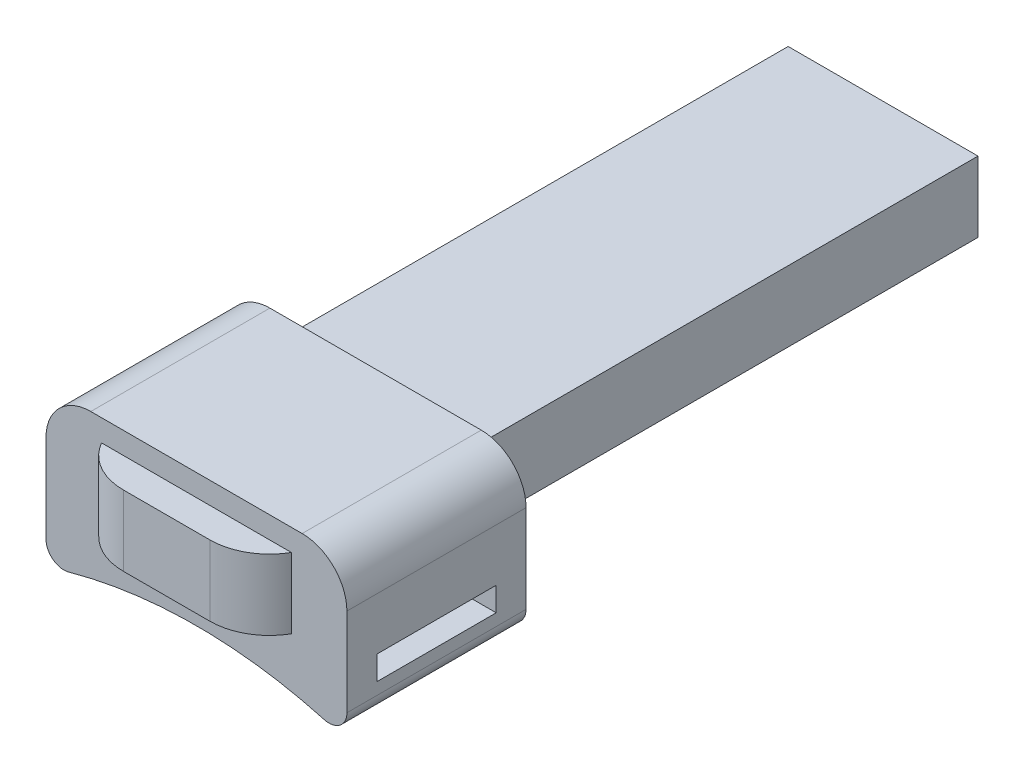
ISO-10303-21;
HEADER;
FILE_DESCRIPTION(('STEP AP214'),'2;1');
FILE_NAME('part.step','',(''),(''),'','','');
FILE_SCHEMA(('AUTOMOTIVE_DESIGN { 1 0 10303 214 1 1 1 1 }'));
ENDSEC;
DATA;
#1=APPLICATION_CONTEXT('core data for automotive mechanical design processes');
#2=APPLICATION_PROTOCOL_DEFINITION('international standard','automotive_design',2000,#1);
#3=PRODUCT_CONTEXT('',#1,'mechanical');
#4=PRODUCT('Part','Part','',(#3));
#5=PRODUCT_RELATED_PRODUCT_CATEGORY('part','',(#4));
#6=PRODUCT_DEFINITION_FORMATION('','',#4);
#7=PRODUCT_DEFINITION_CONTEXT('part definition',#1,'design');
#8=PRODUCT_DEFINITION('design','',#6,#7);
#9=PRODUCT_DEFINITION_SHAPE('','',#8);
#10=(LENGTH_UNIT() NAMED_UNIT(*) SI_UNIT(.MILLI.,.METRE.));
#11=(NAMED_UNIT(*) PLANE_ANGLE_UNIT() SI_UNIT($,.RADIAN.));
#12=(NAMED_UNIT(*) SI_UNIT($,.STERADIAN.) SOLID_ANGLE_UNIT());
#13=UNCERTAINTY_MEASURE_WITH_UNIT(LENGTH_MEASURE(1.E-05),#10,'distance_accuracy_value','');
#14=(GEOMETRIC_REPRESENTATION_CONTEXT(3) GLOBAL_UNCERTAINTY_ASSIGNED_CONTEXT((#13)) GLOBAL_UNIT_ASSIGNED_CONTEXT((#10,
#11,#12)) REPRESENTATION_CONTEXT('',''));
#15=CARTESIAN_POINT('',(0.,0.,0.));
#16=DIRECTION('',(0.,0.,1.));
#17=DIRECTION('',(1.,0.,0.));
#18=AXIS2_PLACEMENT_3D('',#15,#16,#17);
#19=CARTESIAN_POINT('',(-15.9,0.,-120.));
#20=DIRECTION('',(-1.,0.,0.));
#21=DIRECTION('',(0.,0.,1.));
#22=AXIS2_PLACEMENT_3D('',#19,#20,#21);
#23=PLANE('',#22);
#24=DIRECTION('',(0.,0.,1.));
#25=VECTOR('',#24,1.);
#26=CARTESIAN_POINT('',(-15.9,0.,-120.));
#27=LINE('',#26,#25);
#28=CARTESIAN_POINT('',(-15.9,0.,-120.));
#29=VERTEX_POINT('',#28);
#30=CARTESIAN_POINT('',(-15.9,0.,-35.));
#31=VERTEX_POINT('',#30);
#32=EDGE_CURVE('E309',#29,#31,#27,.T.);
#33=ORIENTED_EDGE('',*,*,#32,.T.);
#34=DIRECTION('',(0.,1.,0.));
#35=VECTOR('',#34,1.);
#36=CARTESIAN_POINT('',(-15.9,0.,-35.));
#37=LINE('',#36,#35);
#38=CARTESIAN_POINT('',(-15.9,11.8,-35.));
#39=VERTEX_POINT('',#38);
#40=EDGE_CURVE('E289',#31,#39,#37,.T.);
#41=ORIENTED_EDGE('',*,*,#40,.T.);
#42=DIRECTION('',(0.,0.,1.));
#43=VECTOR('',#42,1.);
#44=CARTESIAN_POINT('',(-15.9,11.8,-120.));
#45=LINE('',#44,#43);
#46=CARTESIAN_POINT('',(-15.9,11.8,-120.));
#47=VERTEX_POINT('',#46);
#48=EDGE_CURVE('E313',#47,#39,#45,.T.);
#49=ORIENTED_EDGE('',*,*,#48,.F.);
#50=DIRECTION('',(0.,-1.,0.));
#51=VECTOR('',#50,1.);
#52=CARTESIAN_POINT('',(-15.9,0.,-120.));
#53=LINE('',#52,#51);
#54=EDGE_CURVE('E302',#47,#29,#53,.T.);
#55=ORIENTED_EDGE('',*,*,#54,.T.);
#56=EDGE_LOOP('',(#33,#41,#49,#55));
#57=FACE_BOUND('',#56,.T.);
#58=ADVANCED_FACE('F39',(#57),#23,.T.);
#59=CARTESIAN_POINT('',(-15.9,11.8,-120.));
#60=DIRECTION('',(0.,1.,0.));
#61=DIRECTION('',(0.,0.,1.));
#62=AXIS2_PLACEMENT_3D('',#59,#60,#61);
#63=PLANE('',#62);
#64=ORIENTED_EDGE('',*,*,#48,.T.);
#65=DIRECTION('',(1.,0.,0.));
#66=VECTOR('',#65,1.);
#67=CARTESIAN_POINT('',(-15.9,11.8,-35.));
#68=LINE('',#67,#66);
#69=CARTESIAN_POINT('',(15.9,11.8,-35.));
#70=VERTEX_POINT('',#69);
#71=EDGE_CURVE('E286',#39,#70,#68,.T.);
#72=ORIENTED_EDGE('',*,*,#71,.T.);
#73=DIRECTION('',(0.,0.,1.));
#74=VECTOR('',#73,1.);
#75=CARTESIAN_POINT('',(15.9,11.8,-120.));
#76=LINE('',#75,#74);
#77=CARTESIAN_POINT('',(15.9,11.8,-120.));
#78=VERTEX_POINT('',#77);
#79=EDGE_CURVE('E316',#78,#70,#76,.T.);
#80=ORIENTED_EDGE('',*,*,#79,.F.);
#81=DIRECTION('',(-1.,0.,0.));
#82=VECTOR('',#81,1.);
#83=CARTESIAN_POINT('',(-15.9,11.8,-120.));
#84=LINE('',#83,#82);
#85=EDGE_CURVE('E299',#78,#47,#84,.T.);
#86=ORIENTED_EDGE('',*,*,#85,.T.);
#87=EDGE_LOOP('',(#64,#72,#80,#86));
#88=FACE_BOUND('',#87,.T.);
#89=ADVANCED_FACE('F363',(#88),#63,.T.);
#90=CARTESIAN_POINT('',(15.9,11.8,-120.));
#91=DIRECTION('',(1.,0.,0.));
#92=DIRECTION('',(0.,0.,-1.));
#93=AXIS2_PLACEMENT_3D('',#90,#91,#92);
#94=PLANE('',#93);
#95=ORIENTED_EDGE('',*,*,#79,.T.);
#96=DIRECTION('',(0.,-1.,0.));
#97=VECTOR('',#96,1.);
#98=CARTESIAN_POINT('',(15.9,11.8,-35.));
#99=LINE('',#98,#97);
#100=CARTESIAN_POINT('',(15.9,0.,-35.));
#101=VERTEX_POINT('',#100);
#102=EDGE_CURVE('E283',#70,#101,#99,.T.);
#103=ORIENTED_EDGE('',*,*,#102,.T.);
#104=DIRECTION('',(0.,0.,1.));
#105=VECTOR('',#104,1.);
#106=CARTESIAN_POINT('',(15.9,0.,-120.));
#107=LINE('',#106,#105);
#108=CARTESIAN_POINT('',(15.9,0.,-120.));
#109=VERTEX_POINT('',#108);
#110=EDGE_CURVE('E305',#109,#101,#107,.T.);
#111=ORIENTED_EDGE('',*,*,#110,.F.);
#112=DIRECTION('',(0.,1.,0.));
#113=VECTOR('',#112,1.);
#114=CARTESIAN_POINT('',(15.9,11.8,-120.));
#115=LINE('',#114,#113);
#116=EDGE_CURVE('E295',#109,#78,#115,.T.);
#117=ORIENTED_EDGE('',*,*,#116,.T.);
#118=EDGE_LOOP('',(#95,#103,#111,#117));
#119=FACE_BOUND('',#118,.T.);
#120=ADVANCED_FACE('F371',(#119),#94,.T.);
#121=CARTESIAN_POINT('',(0.,0.,-120.));
#122=DIRECTION('',(0.,-1.,0.));
#123=DIRECTION('',(0.,0.,-1.));
#124=AXIS2_PLACEMENT_3D('',#121,#122,#123);
#125=PLANE('',#124);
#126=ORIENTED_EDGE('',*,*,#110,.T.);
#127=DIRECTION('',(-1.,0.,0.));
#128=VECTOR('',#127,1.);
#129=CARTESIAN_POINT('',(0.,0.,-35.));
#130=LINE('',#129,#128);
#131=EDGE_CURVE('E323',#101,#31,#130,.T.);
#132=ORIENTED_EDGE('',*,*,#131,.T.);
#133=ORIENTED_EDGE('',*,*,#32,.F.);
#134=DIRECTION('',(1.,0.,0.));
#135=VECTOR('',#134,1.);
#136=CARTESIAN_POINT('',(0.,0.,-120.));
#137=LINE('',#136,#135);
#138=EDGE_CURVE('E293',#29,#109,#137,.T.);
#139=ORIENTED_EDGE('',*,*,#138,.T.);
#140=EDGE_LOOP('',(#126,#132,#133,#139));
#141=FACE_BOUND('',#140,.T.);
#142=ADVANCED_FACE('F377',(#141),#125,.T.);
#143=CARTESIAN_POINT('',(0.,0.,-120.));
#144=DIRECTION('',(0.,0.,-1.));
#145=DIRECTION('',(-1.,0.,0.));
#146=AXIS2_PLACEMENT_3D('',#143,#144,#145);
#147=PLANE('',#146);
#148=ORIENTED_EDGE('',*,*,#138,.F.);
#149=ORIENTED_EDGE('',*,*,#54,.F.);
#150=ORIENTED_EDGE('',*,*,#85,.F.);
#151=ORIENTED_EDGE('',*,*,#116,.F.);
#152=EDGE_LOOP('',(#148,#149,#150,#151));
#153=FACE_BOUND('',#152,.T.);
#154=ADVANCED_FACE('F384',(#153),#147,.T.);
#155=CARTESIAN_POINT('',(0.,-86.7751107448839,-35.));
#156=DIRECTION('',(0.,0.,1.));
#157=DIRECTION('',(1.,0.,0.));
#158=AXIS2_PLACEMENT_3D('',#155,#156,#157);
#159=CYLINDRICAL_SURFACE('',#158,80.);
#160=CARTESIAN_POINT('',(0.,-86.7751107448839,-5.));
#161=DIRECTION('',(0.,0.,-1.));
#162=DIRECTION('',(1.,0.,0.));
#163=AXIS2_PLACEMENT_3D('',#160,#161,#162);
#164=CIRCLE('',#163,80.);
#165=CARTESIAN_POINT('',(-21.3975903614458,-9.68981301098555,-5.));
#166=VERTEX_POINT('',#165);
#167=CARTESIAN_POINT('',(21.3975903614458,-9.68981301098554,-5.));
#168=VERTEX_POINT('',#167);
#169=EDGE_CURVE('E210',#166,#168,#164,.T.);
#170=ORIENTED_EDGE('',*,*,#169,.F.);
#171=DIRECTION('',(0.,0.,1.));
#172=VECTOR('',#171,1.);
#173=CARTESIAN_POINT('',(-21.3975903614458,-9.68981301098555,-35.));
#174=LINE('',#173,#172);
#175=CARTESIAN_POINT('',(-21.3975903614458,-9.68981301098555,-35.));
#176=VERTEX_POINT('',#175);
#177=EDGE_CURVE('E256',#176,#166,#174,.T.);
#178=ORIENTED_EDGE('',*,*,#177,.F.);
#179=CARTESIAN_POINT('',(0.,-86.7751107448839,-35.));
#180=DIRECTION('',(0.,0.,-1.));
#181=DIRECTION('',(1.,0.,0.));
#182=AXIS2_PLACEMENT_3D('',#179,#180,#181);
#183=CIRCLE('',#182,80.);
#184=CARTESIAN_POINT('',(21.3975903614458,-9.68981301098554,-35.));
#185=VERTEX_POINT('',#184);
#186=EDGE_CURVE('E211',#176,#185,#183,.T.);
#187=ORIENTED_EDGE('',*,*,#186,.T.);
#188=DIRECTION('',(0.,0.,1.));
#189=VECTOR('',#188,1.);
#190=CARTESIAN_POINT('',(21.3975903614458,-9.68981301098554,-35.));
#191=LINE('',#190,#189);
#192=EDGE_CURVE('E233',#185,#168,#191,.T.);
#193=ORIENTED_EDGE('',*,*,#192,.T.);
#194=EDGE_LOOP('',(#170,#178,#187,#193));
#195=FACE_BOUND('',#194,.T.);
#196=ADVANCED_FACE('F389',(#195),#159,.F.);
#197=CARTESIAN_POINT('',(-22.2,-6.79911434596435,-35.));
#198=DIRECTION('',(0.,0.,1.));
#199=DIRECTION('',(1.,0.,0.));
#200=AXIS2_PLACEMENT_3D('',#197,#198,#199);
#201=CYLINDRICAL_SURFACE('',#200,3.00000000000001);
#202=CARTESIAN_POINT('',(-22.2,-6.79911434596435,-5.));
#203=DIRECTION('',(0.,0.,1.));
#204=DIRECTION('',(1.,0.,0.));
#205=AXIS2_PLACEMENT_3D('',#202,#203,#204);
#206=CIRCLE('',#205,3.00000000000001);
#207=CARTESIAN_POINT('',(-25.2,-6.79911434596435,-5.));
#208=VERTEX_POINT('',#207);
#209=EDGE_CURVE('E215',#208,#166,#206,.T.);
#210=ORIENTED_EDGE('',*,*,#209,.F.);
#211=DIRECTION('',(0.,0.,1.));
#212=VECTOR('',#211,1.);
#213=CARTESIAN_POINT('',(-25.2,-6.79911434596435,-35.));
#214=LINE('',#213,#212);
#215=CARTESIAN_POINT('',(-25.2,-6.79911434596435,-35.));
#216=VERTEX_POINT('',#215);
#217=EDGE_CURVE('E259',#216,#208,#214,.T.);
#218=ORIENTED_EDGE('',*,*,#217,.F.);
#219=CARTESIAN_POINT('',(-22.2,-6.79911434596435,-35.));
#220=DIRECTION('',(0.,0.,1.));
#221=DIRECTION('',(1.,0.,0.));
#222=AXIS2_PLACEMENT_3D('',#219,#220,#221);
#223=CIRCLE('',#222,3.00000000000001);
#224=EDGE_CURVE('E230',#216,#176,#223,.T.);
#225=ORIENTED_EDGE('',*,*,#224,.T.);
#226=ORIENTED_EDGE('',*,*,#177,.T.);
#227=EDGE_LOOP('',(#210,#218,#225,#226));
#228=FACE_BOUND('',#227,.T.);
#229=ADVANCED_FACE('F411',(#228),#201,.T.);
#230=CARTESIAN_POINT('',(-25.2,-4.05,-35.));
#231=DIRECTION('',(-1.,0.,0.));
#232=DIRECTION('',(0.,0.,1.));
#233=AXIS2_PLACEMENT_3D('',#230,#231,#232);
#234=PLANE('',#233);
#235=DIRECTION('',(0.,1.,0.));
#236=VECTOR('',#235,1.);
#237=CARTESIAN_POINT('',(-25.2,-4.05,-10.));
#238=LINE('',#237,#236);
#239=CARTESIAN_POINT('',(-25.2,-4.79911434596435,-10.));
#240=VERTEX_POINT('',#239);
#241=CARTESIAN_POINT('',(-25.2,-0.799114345964353,-10.));
#242=VERTEX_POINT('',#241);
#243=EDGE_CURVE('E208',#240,#242,#238,.T.);
#244=ORIENTED_EDGE('',*,*,#243,.F.);
#245=DIRECTION('',(0.,0.,1.));
#246=VECTOR('',#245,1.);
#247=CARTESIAN_POINT('',(-25.2,-4.79911434596435,-35.));
#248=LINE('',#247,#246);
#249=CARTESIAN_POINT('',(-25.2,-4.79911434596435,-30.));
#250=VERTEX_POINT('',#249);
#251=EDGE_CURVE('E200',#250,#240,#248,.T.);
#252=ORIENTED_EDGE('',*,*,#251,.F.);
#253=DIRECTION('',(0.,-1.,0.));
#254=VECTOR('',#253,1.);
#255=CARTESIAN_POINT('',(-25.2,-4.05,-30.));
#256=LINE('',#255,#254);
#257=CARTESIAN_POINT('',(-25.2,-0.799114345964351,-30.));
#258=VERTEX_POINT('',#257);
#259=EDGE_CURVE('E181',#258,#250,#256,.T.);
#260=ORIENTED_EDGE('',*,*,#259,.F.);
#261=DIRECTION('',(0.,0.,-1.));
#262=VECTOR('',#261,1.);
#263=CARTESIAN_POINT('',(-25.2,-0.799114345964351,-35.));
#264=LINE('',#263,#262);
#265=EDGE_CURVE('E206',#242,#258,#264,.T.);
#266=ORIENTED_EDGE('',*,*,#265,.F.);
#267=EDGE_LOOP('',(#244,#252,#260,#266));
#268=FACE_BOUND('',#267,.T.);
#269=DIRECTION('',(0.,-1.,0.));
#270=VECTOR('',#269,1.);
#271=CARTESIAN_POINT('',(-25.2,-4.05,-5.));
#272=LINE('',#271,#270);
#273=CARTESIAN_POINT('',(-25.2,7.95,-5.));
#274=VERTEX_POINT('',#273);
#275=EDGE_CURVE('E251',#274,#208,#272,.T.);
#276=ORIENTED_EDGE('',*,*,#275,.F.);
#277=DIRECTION('',(0.,0.,1.));
#278=VECTOR('',#277,1.);
#279=CARTESIAN_POINT('',(-25.2,7.95,-35.));
#280=LINE('',#279,#278);
#281=CARTESIAN_POINT('',(-25.2,7.95,-35.));
#282=VERTEX_POINT('',#281);
#283=EDGE_CURVE('E261',#282,#274,#280,.T.);
#284=ORIENTED_EDGE('',*,*,#283,.F.);
#285=DIRECTION('',(0.,-1.,0.));
#286=VECTOR('',#285,1.);
#287=CARTESIAN_POINT('',(-25.2,7.95,-35.));
#288=LINE('',#287,#286);
#289=EDGE_CURVE('E228',#282,#216,#288,.T.);
#290=ORIENTED_EDGE('',*,*,#289,.T.);
#291=ORIENTED_EDGE('',*,*,#217,.T.);
#292=EDGE_LOOP('',(#276,#284,#290,#291));
#293=FACE_BOUND('',#292,.T.);
#294=ADVANCED_FACE('F414',(#268,#293),#234,.T.);
#295=CARTESIAN_POINT('',(-17.7,7.95,-35.));
#296=DIRECTION('',(0.,0.,1.));
#297=DIRECTION('',(1.,0.,0.));
#298=AXIS2_PLACEMENT_3D('',#295,#296,#297);
#299=CYLINDRICAL_SURFACE('',#298,7.5);
#300=CARTESIAN_POINT('',(-17.7,7.95,-5.));
#301=DIRECTION('',(0.,0.,1.));
#302=DIRECTION('',(1.,0.,0.));
#303=AXIS2_PLACEMENT_3D('',#300,#301,#302);
#304=CIRCLE('',#303,7.5);
#305=CARTESIAN_POINT('',(-17.7,15.45,-5.));
#306=VERTEX_POINT('',#305);
#307=EDGE_CURVE('E248',#306,#274,#304,.T.);
#308=ORIENTED_EDGE('',*,*,#307,.F.);
#309=DIRECTION('',(0.,0.,1.));
#310=VECTOR('',#309,1.);
#311=CARTESIAN_POINT('',(-17.7,15.45,-35.));
#312=LINE('',#311,#310);
#313=CARTESIAN_POINT('',(-17.7,15.45,-35.));
#314=VERTEX_POINT('',#313);
#315=EDGE_CURVE('E264',#314,#306,#312,.T.);
#316=ORIENTED_EDGE('',*,*,#315,.F.);
#317=CARTESIAN_POINT('',(-17.7,7.95,-35.));
#318=DIRECTION('',(0.,0.,1.));
#319=DIRECTION('',(1.,0.,0.));
#320=AXIS2_PLACEMENT_3D('',#317,#318,#319);
#321=CIRCLE('',#320,7.5);
#322=EDGE_CURVE('E225',#314,#282,#321,.T.);
#323=ORIENTED_EDGE('',*,*,#322,.T.);
#324=ORIENTED_EDGE('',*,*,#283,.T.);
#325=EDGE_LOOP('',(#308,#316,#323,#324));
#326=FACE_BOUND('',#325,.T.);
#327=ADVANCED_FACE('F418',(#326),#299,.T.);
#328=CARTESIAN_POINT('',(-15.9,15.45,-35.));
#329=DIRECTION('',(0.,1.,0.));
#330=DIRECTION('',(0.,0.,1.));
#331=AXIS2_PLACEMENT_3D('',#328,#329,#330);
#332=PLANE('',#331);
#333=DIRECTION('',(-1.,0.,0.));
#334=VECTOR('',#333,1.);
#335=CARTESIAN_POINT('',(-15.9,15.45,-5.));
#336=LINE('',#335,#334);
#337=CARTESIAN_POINT('',(17.7,15.45,-5.));
#338=VERTEX_POINT('',#337);
#339=EDGE_CURVE('E245',#338,#306,#336,.T.);
#340=ORIENTED_EDGE('',*,*,#339,.F.);
#341=DIRECTION('',(0.,0.,1.));
#342=VECTOR('',#341,1.);
#343=CARTESIAN_POINT('',(17.7,15.45,-35.));
#344=LINE('',#343,#342);
#345=CARTESIAN_POINT('',(17.7,15.45,-35.));
#346=VERTEX_POINT('',#345);
#347=EDGE_CURVE('E266',#346,#338,#344,.T.);
#348=ORIENTED_EDGE('',*,*,#347,.F.);
#349=DIRECTION('',(-1.,0.,0.));
#350=VECTOR('',#349,1.);
#351=CARTESIAN_POINT('',(-15.9,15.45,-35.));
#352=LINE('',#351,#350);
#353=EDGE_CURVE('E223',#346,#314,#352,.T.);
#354=ORIENTED_EDGE('',*,*,#353,.T.);
#355=ORIENTED_EDGE('',*,*,#315,.T.);
#356=EDGE_LOOP('',(#340,#348,#354,#355));
#357=FACE_BOUND('',#356,.T.);
#358=ADVANCED_FACE('F442',(#357),#332,.T.);
#359=CARTESIAN_POINT('',(17.7,7.95,-35.));
#360=DIRECTION('',(0.,0.,1.));
#361=DIRECTION('',(1.,0.,0.));
#362=AXIS2_PLACEMENT_3D('',#359,#360,#361);
#363=CYLINDRICAL_SURFACE('',#362,7.5);
#364=CARTESIAN_POINT('',(17.7,7.95,-5.));
#365=DIRECTION('',(0.,0.,1.));
#366=DIRECTION('',(1.,0.,0.));
#367=AXIS2_PLACEMENT_3D('',#364,#365,#366);
#368=CIRCLE('',#367,7.5);
#369=CARTESIAN_POINT('',(25.2,7.95,-5.));
#370=VERTEX_POINT('',#369);
#371=EDGE_CURVE('E242',#370,#338,#368,.T.);
#372=ORIENTED_EDGE('',*,*,#371,.F.);
#373=DIRECTION('',(0.,0.,1.));
#374=VECTOR('',#373,1.);
#375=CARTESIAN_POINT('',(25.2,7.95,-35.));
#376=LINE('',#375,#374);
#377=CARTESIAN_POINT('',(25.2,7.95,-35.));
#378=VERTEX_POINT('',#377);
#379=EDGE_CURVE('E269',#378,#370,#376,.T.);
#380=ORIENTED_EDGE('',*,*,#379,.F.);
#381=CARTESIAN_POINT('',(17.7,7.95,-35.));
#382=DIRECTION('',(0.,0.,1.));
#383=DIRECTION('',(1.,0.,0.));
#384=AXIS2_PLACEMENT_3D('',#381,#382,#383);
#385=CIRCLE('',#384,7.5);
#386=EDGE_CURVE('E220',#378,#346,#385,.T.);
#387=ORIENTED_EDGE('',*,*,#386,.T.);
#388=ORIENTED_EDGE('',*,*,#347,.T.);
#389=EDGE_LOOP('',(#372,#380,#387,#388));
#390=FACE_BOUND('',#389,.T.);
#391=ADVANCED_FACE('F426',(#390),#363,.T.);
#392=CARTESIAN_POINT('',(25.2,7.95,-35.));
#393=DIRECTION('',(1.,0.,0.));
#394=DIRECTION('',(0.,0.,-1.));
#395=AXIS2_PLACEMENT_3D('',#392,#393,#394);
#396=PLANE('',#395);
#397=DIRECTION('',(0.,-1.,0.));
#398=VECTOR('',#397,1.);
#399=CARTESIAN_POINT('',(25.2,-0.799114345964353,-10.));
#400=LINE('',#399,#398);
#401=CARTESIAN_POINT('',(25.2,-0.799114345964353,-10.));
#402=VERTEX_POINT('',#401);
#403=CARTESIAN_POINT('',(25.2,-4.79911434596435,-10.));
#404=VERTEX_POINT('',#403);
#405=EDGE_CURVE('E62',#402,#404,#400,.T.);
#406=ORIENTED_EDGE('',*,*,#405,.F.);
#407=DIRECTION('',(0.,0.,1.));
#408=VECTOR('',#407,1.);
#409=CARTESIAN_POINT('',(25.2,-0.799114345964351,-30.));
#410=LINE('',#409,#408);
#411=CARTESIAN_POINT('',(25.2,-0.799114345964351,-30.));
#412=VERTEX_POINT('',#411);
#413=EDGE_CURVE('E194',#412,#402,#410,.T.);
#414=ORIENTED_EDGE('',*,*,#413,.F.);
#415=DIRECTION('',(0.,1.,0.));
#416=VECTOR('',#415,1.);
#417=CARTESIAN_POINT('',(25.2,-4.79911434596435,-30.));
#418=LINE('',#417,#416);
#419=CARTESIAN_POINT('',(25.2,-4.79911434596435,-30.));
#420=VERTEX_POINT('',#419);
#421=EDGE_CURVE('E178',#420,#412,#418,.T.);
#422=ORIENTED_EDGE('',*,*,#421,.F.);
#423=DIRECTION('',(0.,0.,-1.));
#424=VECTOR('',#423,1.);
#425=CARTESIAN_POINT('',(25.2,-4.79911434596435,-20.));
#426=LINE('',#425,#424);
#427=EDGE_CURVE('E186',#404,#420,#426,.T.);
#428=ORIENTED_EDGE('',*,*,#427,.F.);
#429=EDGE_LOOP('',(#406,#414,#422,#428));
#430=FACE_BOUND('',#429,.T.);
#431=DIRECTION('',(0.,1.,0.));
#432=VECTOR('',#431,1.);
#433=CARTESIAN_POINT('',(25.2,7.95,-5.));
#434=LINE('',#433,#432);
#435=CARTESIAN_POINT('',(25.2,-6.79911434596435,-5.));
#436=VERTEX_POINT('',#435);
#437=EDGE_CURVE('E239',#436,#370,#434,.T.);
#438=ORIENTED_EDGE('',*,*,#437,.F.);
#439=DIRECTION('',(0.,0.,1.));
#440=VECTOR('',#439,1.);
#441=CARTESIAN_POINT('',(25.2,-6.79911434596435,-35.));
#442=LINE('',#441,#440);
#443=CARTESIAN_POINT('',(25.2,-6.79911434596435,-35.));
#444=VERTEX_POINT('',#443);
#445=EDGE_CURVE('E271',#444,#436,#442,.T.);
#446=ORIENTED_EDGE('',*,*,#445,.F.);
#447=DIRECTION('',(0.,1.,0.));
#448=VECTOR('',#447,1.);
#449=CARTESIAN_POINT('',(25.2,-6.79911434596435,-35.));
#450=LINE('',#449,#448);
#451=EDGE_CURVE('E218',#444,#378,#450,.T.);
#452=ORIENTED_EDGE('',*,*,#451,.T.);
#453=ORIENTED_EDGE('',*,*,#379,.T.);
#454=EDGE_LOOP('',(#438,#446,#452,#453));
#455=FACE_BOUND('',#454,.T.);
#456=ADVANCED_FACE('F191',(#430,#455),#396,.T.);
#457=CARTESIAN_POINT('',(22.2,-6.79911434596435,-35.));
#458=DIRECTION('',(0.,0.,1.));
#459=DIRECTION('',(1.,0.,0.));
#460=AXIS2_PLACEMENT_3D('',#457,#458,#459);
#461=CYLINDRICAL_SURFACE('',#460,3.00000000000001);
#462=CARTESIAN_POINT('',(22.2,-6.79911434596435,-5.));
#463=DIRECTION('',(0.,0.,1.));
#464=DIRECTION('',(1.,0.,0.));
#465=AXIS2_PLACEMENT_3D('',#462,#463,#464);
#466=CIRCLE('',#465,3.00000000000001);
#467=EDGE_CURVE('E236',#168,#436,#466,.T.);
#468=ORIENTED_EDGE('',*,*,#467,.F.);
#469=ORIENTED_EDGE('',*,*,#192,.F.);
#470=CARTESIAN_POINT('',(22.2,-6.79911434596435,-35.));
#471=DIRECTION('',(0.,0.,1.));
#472=DIRECTION('',(1.,0.,0.));
#473=AXIS2_PLACEMENT_3D('',#470,#471,#472);
#474=CIRCLE('',#473,3.00000000000001);
#475=EDGE_CURVE('E214',#185,#444,#474,.T.);
#476=ORIENTED_EDGE('',*,*,#475,.T.);
#477=ORIENTED_EDGE('',*,*,#445,.T.);
#478=EDGE_LOOP('',(#468,#469,#476,#477));
#479=FACE_BOUND('',#478,.T.);
#480=ADVANCED_FACE('F400',(#479),#461,.T.);
#481=CARTESIAN_POINT('',(0.,-86.7751107448839,-35.));
#482=DIRECTION('',(0.,0.,1.));
#483=DIRECTION('',(1.,0.,0.));
#484=AXIS2_PLACEMENT_3D('',#481,#482,#483);
#485=PLANE('',#484);
#486=ORIENTED_EDGE('',*,*,#40,.F.);
#487=ORIENTED_EDGE('',*,*,#131,.F.);
#488=ORIENTED_EDGE('',*,*,#102,.F.);
#489=ORIENTED_EDGE('',*,*,#71,.F.);
#490=EDGE_LOOP('',(#486,#487,#488,#489));
#491=FACE_BOUND('',#490,.T.);
#492=ORIENTED_EDGE('',*,*,#186,.F.);
#493=ORIENTED_EDGE('',*,*,#224,.F.);
#494=ORIENTED_EDGE('',*,*,#289,.F.);
#495=ORIENTED_EDGE('',*,*,#322,.F.);
#496=ORIENTED_EDGE('',*,*,#353,.F.);
#497=ORIENTED_EDGE('',*,*,#386,.F.);
#498=ORIENTED_EDGE('',*,*,#451,.F.);
#499=ORIENTED_EDGE('',*,*,#475,.F.);
#500=EDGE_LOOP('',(#492,#493,#494,#495,#496,#497,#498,#499));
#501=FACE_BOUND('',#500,.T.);
#502=ADVANCED_FACE('F397',(#491,#501),#485,.F.);
#503=CARTESIAN_POINT('',(0.,-86.7751107448839,-5.));
#504=DIRECTION('',(0.,0.,1.));
#505=DIRECTION('',(1.,0.,0.));
#506=AXIS2_PLACEMENT_3D('',#503,#504,#505);
#507=PLANE('',#506);
#508=DIRECTION('',(-1.,0.,0.));
#509=VECTOR('',#508,1.);
#510=CARTESIAN_POINT('',(0.,0.,-5.));
#511=LINE('',#510,#509);
#512=CARTESIAN_POINT('',(15.9,0.,-5.));
#513=VERTEX_POINT('',#512);
#514=CARTESIAN_POINT('',(-15.9,0.,-5.));
#515=VERTEX_POINT('',#514);
#516=EDGE_CURVE('E312',#513,#515,#511,.T.);
#517=ORIENTED_EDGE('',*,*,#516,.T.);
#518=DIRECTION('',(0.,1.,0.));
#519=VECTOR('',#518,1.);
#520=CARTESIAN_POINT('',(-15.9,0.,-5.));
#521=LINE('',#520,#519);
#522=CARTESIAN_POINT('',(-15.9,11.8,-5.));
#523=VERTEX_POINT('',#522);
#524=EDGE_CURVE('E280',#515,#523,#521,.T.);
#525=ORIENTED_EDGE('',*,*,#524,.T.);
#526=DIRECTION('',(1.,0.,0.));
#527=VECTOR('',#526,1.);
#528=CARTESIAN_POINT('',(-15.9,11.8,-5.));
#529=LINE('',#528,#527);
#530=CARTESIAN_POINT('',(15.9,11.8,-5.));
#531=VERTEX_POINT('',#530);
#532=EDGE_CURVE('E277',#523,#531,#529,.T.);
#533=ORIENTED_EDGE('',*,*,#532,.T.);
#534=DIRECTION('',(0.,-1.,0.));
#535=VECTOR('',#534,1.);
#536=CARTESIAN_POINT('',(15.9,11.8,-5.));
#537=LINE('',#536,#535);
#538=EDGE_CURVE('E258',#531,#513,#537,.T.);
#539=ORIENTED_EDGE('',*,*,#538,.T.);
#540=EDGE_LOOP('',(#517,#525,#533,#539));
#541=FACE_BOUND('',#540,.T.);
#542=ORIENTED_EDGE('',*,*,#169,.T.);
#543=ORIENTED_EDGE('',*,*,#467,.T.);
#544=ORIENTED_EDGE('',*,*,#437,.T.);
#545=ORIENTED_EDGE('',*,*,#371,.T.);
#546=ORIENTED_EDGE('',*,*,#339,.T.);
#547=ORIENTED_EDGE('',*,*,#307,.T.);
#548=ORIENTED_EDGE('',*,*,#275,.T.);
#549=ORIENTED_EDGE('',*,*,#209,.T.);
#550=EDGE_LOOP('',(#542,#543,#544,#545,#546,#547,#548,#549));
#551=FACE_BOUND('',#550,.T.);
#552=ADVANCED_FACE('F343',(#541,#551),#507,.T.);
#553=CARTESIAN_POINT('',(0.,0.,0.));
#554=DIRECTION('',(0.,0.,-1.));
#555=DIRECTION('',(-1.,0.,0.));
#556=AXIS2_PLACEMENT_3D('',#553,#554,#555);
#557=PLANE('',#556);
#558=DIRECTION('',(-1.,0.,0.));
#559=VECTOR('',#558,1.);
#560=CARTESIAN_POINT('',(-15.9,11.8,0.));
#561=LINE('',#560,#559);
#562=CARTESIAN_POINT('',(7.23974596215561,11.8,0.));
#563=VERTEX_POINT('',#562);
#564=CARTESIAN_POINT('',(-7.23974596215561,11.8,0.));
#565=VERTEX_POINT('',#564);
#566=EDGE_CURVE('E296',#563,#565,#561,.T.);
#567=ORIENTED_EDGE('',*,*,#566,.T.);
#568=DIRECTION('',(0.,1.,0.));
#569=VECTOR('',#568,1.);
#570=CARTESIAN_POINT('',(-7.23974596215561,0.,0.));
#571=LINE('',#570,#569);
#572=CARTESIAN_POINT('',(-7.23974596215561,0.,0.));
#573=VERTEX_POINT('',#572);
#574=EDGE_CURVE('E334',#565,#573,#571,.F.);
#575=ORIENTED_EDGE('',*,*,#574,.T.);
#576=DIRECTION('',(1.,0.,0.));
#577=VECTOR('',#576,1.);
#578=CARTESIAN_POINT('',(0.,0.,0.));
#579=LINE('',#578,#577);
#580=CARTESIAN_POINT('',(7.23974596215561,0.,0.));
#581=VERTEX_POINT('',#580);
#582=EDGE_CURVE('E292',#573,#581,#579,.T.);
#583=ORIENTED_EDGE('',*,*,#582,.T.);
#584=DIRECTION('',(0.,-1.,0.));
#585=VECTOR('',#584,1.);
#586=CARTESIAN_POINT('',(7.23974596215561,0.,0.));
#587=LINE('',#586,#585);
#588=EDGE_CURVE('E326',#581,#563,#587,.F.);
#589=ORIENTED_EDGE('',*,*,#588,.T.);
#590=EDGE_LOOP('',(#567,#575,#583,#589));
#591=FACE_BOUND('',#590,.T.);
#592=ADVANCED_FACE('F352',(#591),#557,.F.);
#593=ORIENTED_EDGE('',*,*,#582,.F.);
#594=CARTESIAN_POINT('',(-7.23974596215561,0.,-10.));
#595=DIRECTION('',(0.,-1.,0.));
#596=DIRECTION('',(0.,0.,-1.));
#597=AXIS2_PLACEMENT_3D('',#594,#595,#596);
#598=CIRCLE('',#597,10.);
#599=EDGE_CURVE('E47',#573,#515,#598,.T.);
#600=ORIENTED_EDGE('',*,*,#599,.T.);
#601=ORIENTED_EDGE('',*,*,#516,.F.);
#602=CARTESIAN_POINT('',(7.23974596215561,0.,-10.));
#603=DIRECTION('',(0.,-1.,0.));
#604=DIRECTION('',(0.,0.,-1.));
#605=AXIS2_PLACEMENT_3D('',#602,#603,#604);
#606=CIRCLE('',#605,10.);
#607=EDGE_CURVE('E331',#513,#581,#606,.T.);
#608=ORIENTED_EDGE('',*,*,#607,.T.);
#609=EDGE_LOOP('',(#593,#600,#601,#608));
#610=FACE_BOUND('',#609,.T.);
#611=ADVANCED_FACE('F338',(#610),#125,.T.);
#612=ORIENTED_EDGE('',*,*,#532,.F.);
#613=CARTESIAN_POINT('',(-7.23974596215561,11.8,-10.));
#614=DIRECTION('',(0.,1.,0.));
#615=DIRECTION('',(0.,0.,1.));
#616=AXIS2_PLACEMENT_3D('',#613,#614,#615);
#617=CIRCLE('',#616,10.);
#618=EDGE_CURVE('E11',#523,#565,#617,.T.);
#619=ORIENTED_EDGE('',*,*,#618,.T.);
#620=ORIENTED_EDGE('',*,*,#566,.F.);
#621=CARTESIAN_POINT('',(7.23974596215561,11.8,-10.));
#622=DIRECTION('',(0.,1.,0.));
#623=DIRECTION('',(0.,0.,1.));
#624=AXIS2_PLACEMENT_3D('',#621,#622,#623);
#625=CIRCLE('',#624,10.);
#626=EDGE_CURVE('E329',#563,#531,#625,.T.);
#627=ORIENTED_EDGE('',*,*,#626,.T.);
#628=EDGE_LOOP('',(#612,#619,#620,#627));
#629=FACE_BOUND('',#628,.T.);
#630=ADVANCED_FACE('F350',(#629),#63,.T.);
#631=CARTESIAN_POINT('',(7.23974596215561,11.8,-10.));
#632=DIRECTION('',(0.,-1.,0.));
#633=DIRECTION('',(0.,0.,-1.));
#634=AXIS2_PLACEMENT_3D('',#631,#632,#633);
#635=CYLINDRICAL_SURFACE('',#634,10.);
#636=ORIENTED_EDGE('',*,*,#607,.F.);
#637=ORIENTED_EDGE('',*,*,#538,.F.);
#638=ORIENTED_EDGE('',*,*,#626,.F.);
#639=ORIENTED_EDGE('',*,*,#588,.F.);
#640=EDGE_LOOP('',(#636,#637,#638,#639));
#641=FACE_BOUND('',#640,.T.);
#642=ADVANCED_FACE('F355',(#641),#635,.T.);
#643=CARTESIAN_POINT('',(-7.23974596215561,0.,-10.));
#644=DIRECTION('',(0.,1.,0.));
#645=DIRECTION('',(0.,0.,1.));
#646=AXIS2_PLACEMENT_3D('',#643,#644,#645);
#647=CYLINDRICAL_SURFACE('',#646,10.);
#648=ORIENTED_EDGE('',*,*,#618,.F.);
#649=ORIENTED_EDGE('',*,*,#524,.F.);
#650=ORIENTED_EDGE('',*,*,#599,.F.);
#651=ORIENTED_EDGE('',*,*,#574,.F.);
#652=EDGE_LOOP('',(#648,#649,#650,#651));
#653=FACE_BOUND('',#652,.T.);
#654=ADVANCED_FACE('F41',(#653),#647,.T.);
#655=CARTESIAN_POINT('',(-59.8,-0.799114345964353,-10.));
#656=DIRECTION('',(0.,0.,1.));
#657=DIRECTION('',(1.,0.,0.));
#658=AXIS2_PLACEMENT_3D('',#655,#656,#657);
#659=PLANE('',#658);
#660=ORIENTED_EDGE('',*,*,#243,.T.);
#661=DIRECTION('',(1.,0.,0.));
#662=VECTOR('',#661,1.);
#663=CARTESIAN_POINT('',(-59.8,-0.799114345964353,-10.));
#664=LINE('',#663,#662);
#665=EDGE_CURVE('E201',#242,#402,#664,.T.);
#666=ORIENTED_EDGE('',*,*,#665,.T.);
#667=ORIENTED_EDGE('',*,*,#405,.T.);
#668=DIRECTION('',(1.,0.,0.));
#669=VECTOR('',#668,1.);
#670=CARTESIAN_POINT('',(-59.8,-4.79911434596435,-10.));
#671=LINE('',#670,#669);
#672=EDGE_CURVE('E188',#240,#404,#671,.T.);
#673=ORIENTED_EDGE('',*,*,#672,.F.);
#674=EDGE_LOOP('',(#660,#666,#667,#673));
#675=FACE_BOUND('',#674,.T.);
#676=ADVANCED_FACE('F361',(#675),#659,.F.);
#677=CARTESIAN_POINT('',(-59.8,-0.799114345964351,-30.));
#678=DIRECTION('',(0.,1.,0.));
#679=DIRECTION('',(0.,0.,1.));
#680=AXIS2_PLACEMENT_3D('',#677,#678,#679);
#681=PLANE('',#680);
#682=ORIENTED_EDGE('',*,*,#265,.T.);
#683=DIRECTION('',(1.,0.,0.));
#684=VECTOR('',#683,1.);
#685=CARTESIAN_POINT('',(-59.8,-0.799114345964351,-30.));
#686=LINE('',#685,#684);
#687=EDGE_CURVE('E183',#258,#412,#686,.T.);
#688=ORIENTED_EDGE('',*,*,#687,.T.);
#689=ORIENTED_EDGE('',*,*,#413,.T.);
#690=ORIENTED_EDGE('',*,*,#665,.F.);
#691=EDGE_LOOP('',(#682,#688,#689,#690));
#692=FACE_BOUND('',#691,.T.);
#693=ADVANCED_FACE('F456',(#692),#681,.F.);
#694=CARTESIAN_POINT('',(-59.8,-4.79911434596435,-30.));
#695=DIRECTION('',(0.,0.,-1.));
#696=DIRECTION('',(-1.,0.,0.));
#697=AXIS2_PLACEMENT_3D('',#694,#695,#696);
#698=PLANE('',#697);
#699=ORIENTED_EDGE('',*,*,#259,.T.);
#700=DIRECTION('',(1.,0.,0.));
#701=VECTOR('',#700,1.);
#702=CARTESIAN_POINT('',(-59.8,-4.79911434596435,-30.));
#703=LINE('',#702,#701);
#704=EDGE_CURVE('E54',#250,#420,#703,.T.);
#705=ORIENTED_EDGE('',*,*,#704,.T.);
#706=ORIENTED_EDGE('',*,*,#421,.T.);
#707=ORIENTED_EDGE('',*,*,#687,.F.);
#708=EDGE_LOOP('',(#699,#705,#706,#707));
#709=FACE_BOUND('',#708,.T.);
#710=ADVANCED_FACE('F175',(#709),#698,.F.);
#711=CARTESIAN_POINT('',(-59.8,-4.79911434596435,-20.));
#712=DIRECTION('',(0.,-1.,0.));
#713=DIRECTION('',(0.,0.,-1.));
#714=AXIS2_PLACEMENT_3D('',#711,#712,#713);
#715=PLANE('',#714);
#716=ORIENTED_EDGE('',*,*,#251,.T.);
#717=ORIENTED_EDGE('',*,*,#672,.T.);
#718=ORIENTED_EDGE('',*,*,#427,.T.);
#719=ORIENTED_EDGE('',*,*,#704,.F.);
#720=EDGE_LOOP('',(#716,#717,#718,#719));
#721=FACE_BOUND('',#720,.T.);
#722=ADVANCED_FACE('F187',(#721),#715,.F.);
#723=CLOSED_SHELL('',(#58,#89,#120,#142,#154,#196,#229,#294,#327,#358,#391,#456,#480,#502,#552,
#592,#611,#630,#642,#654,#676,#693,#710,#722));
#724=MANIFOLD_SOLID_BREP('B2',#723);
#725=ADVANCED_BREP_SHAPE_REPRESENTATION('',(#18,#724),#14);
#726=SHAPE_DEFINITION_REPRESENTATION(#9,#725);
ENDSEC;
END-ISO-10303-21;
